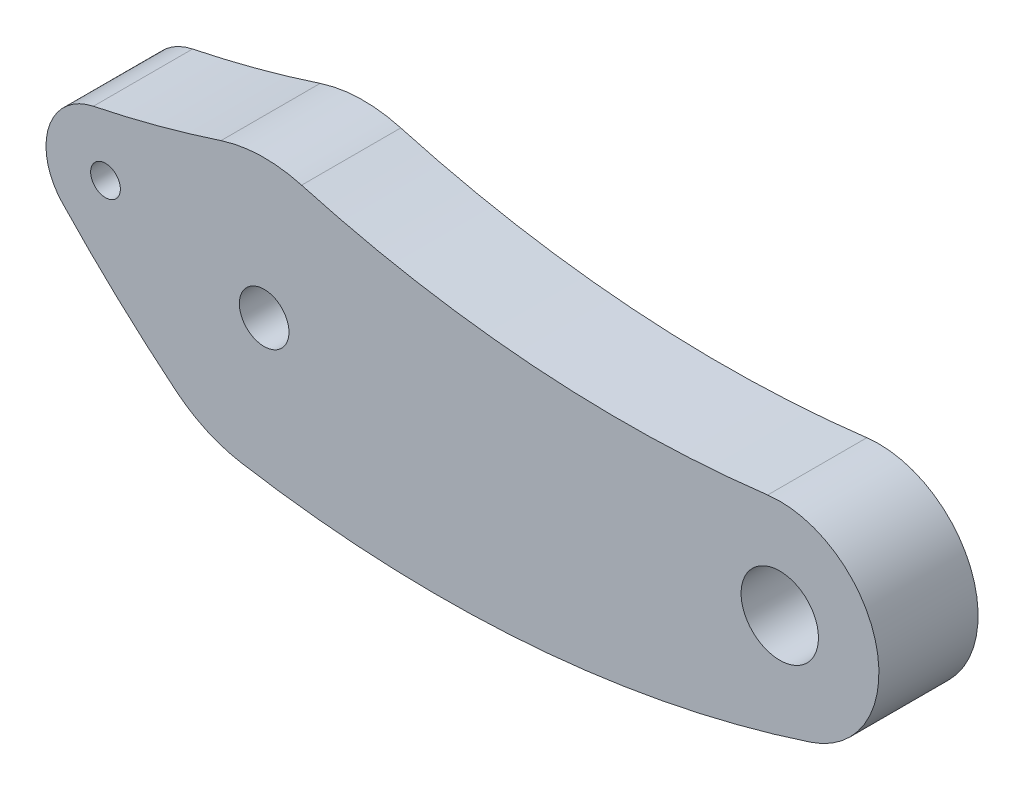
ISO-10303-21;
HEADER;
FILE_DESCRIPTION(('STEP AP214'),'2;1');
FILE_NAME('part.step','',(''),(''),'','','');
FILE_SCHEMA(('AUTOMOTIVE_DESIGN { 1 0 10303 214 1 1 1 1 }'));
ENDSEC;
DATA;
#1=APPLICATION_CONTEXT('core data for automotive mechanical design processes');
#2=APPLICATION_PROTOCOL_DEFINITION('international standard','automotive_design',2000,#1);
#3=PRODUCT_CONTEXT('',#1,'mechanical');
#4=PRODUCT('Part','Part','',(#3));
#5=PRODUCT_RELATED_PRODUCT_CATEGORY('part','',(#4));
#6=PRODUCT_DEFINITION_FORMATION('','',#4);
#7=PRODUCT_DEFINITION_CONTEXT('part definition',#1,'design');
#8=PRODUCT_DEFINITION('design','',#6,#7);
#9=PRODUCT_DEFINITION_SHAPE('','',#8);
#10=(LENGTH_UNIT() NAMED_UNIT(*) SI_UNIT(.MILLI.,.METRE.));
#11=(NAMED_UNIT(*) PLANE_ANGLE_UNIT() SI_UNIT($,.RADIAN.));
#12=(NAMED_UNIT(*) SI_UNIT($,.STERADIAN.) SOLID_ANGLE_UNIT());
#13=UNCERTAINTY_MEASURE_WITH_UNIT(LENGTH_MEASURE(1.E-05),#10,'distance_accuracy_value','');
#14=(GEOMETRIC_REPRESENTATION_CONTEXT(3) GLOBAL_UNCERTAINTY_ASSIGNED_CONTEXT((#13)) GLOBAL_UNIT_ASSIGNED_CONTEXT((#10,
#11,#12)) REPRESENTATION_CONTEXT('',''));
#15=CARTESIAN_POINT('',(0.,0.,0.));
#16=DIRECTION('',(0.,0.,1.));
#17=DIRECTION('',(1.,0.,0.));
#18=AXIS2_PLACEMENT_3D('',#15,#16,#17);
#19=CARTESIAN_POINT('',(17.4230769230769,26.1282680354543,5.));
#20=DIRECTION('',(0.,0.,1.));
#21=DIRECTION('',(1.,0.,0.));
#22=AXIS2_PLACEMENT_3D('',#19,#20,#21);
#23=PLANE('',#22);
#24=CARTESIAN_POINT('',(26.,0.,5.));
#25=DIRECTION('',(0.,0.,1.));
#26=DIRECTION('',(1.,0.,0.));
#27=AXIS2_PLACEMENT_3D('',#24,#25,#26);
#28=CIRCLE('',#27,1.95);
#29=CARTESIAN_POINT('',(27.95,0.,5.));
#30=VERTEX_POINT('',#29);
#31=EDGE_CURVE('E217',#30,#30,#28,.T.);
#32=ORIENTED_EDGE('',*,*,#31,.F.);
#33=EDGE_LOOP('',(#32));
#34=FACE_BOUND('',#33,.T.);
#35=CARTESIAN_POINT('',(8.84615384615384,52.2565360709087,5.));
#36=DIRECTION('',(0.,0.,1.));
#37=DIRECTION('',(1.,0.,0.));
#38=AXIS2_PLACEMENT_3D('',#35,#36,#37);
#39=CIRCLE('',#38,60.);
#40=CARTESIAN_POINT('',(-1.16835994194485,-6.90180665087473,5.));
#41=VERTEX_POINT('',#40);
#42=CARTESIAN_POINT('',(27.5594405594406,-4.75059418826443,5.));
#43=VERTEX_POINT('',#42);
#44=EDGE_CURVE('E168',#41,#43,#39,.T.);
#45=ORIENTED_EDGE('',*,*,#44,.T.);
#46=CARTESIAN_POINT('',(26.,0.,5.));
#47=DIRECTION('',(0.,0.,1.));
#48=DIRECTION('',(1.,0.,0.));
#49=AXIS2_PLACEMENT_3D('',#46,#47,#48);
#50=CIRCLE('',#49,5.);
#51=CARTESIAN_POINT('',(25.3905325443787,4.9627159318803,5.));
#52=VERTEX_POINT('',#51);
#53=EDGE_CURVE('E104',#43,#52,#50,.T.);
#54=ORIENTED_EDGE('',*,*,#53,.T.);
#55=CARTESIAN_POINT('',(18.0769230769231,64.5153071144438,5.));
#56=DIRECTION('',(0.,0.,-1.));
#57=DIRECTION('',(1.,0.,0.));
#58=AXIS2_PLACEMENT_3D('',#55,#56,#57);
#59=CIRCLE('',#58,60.);
#60=CARTESIAN_POINT('',(1.88863375430538,6.74040522091205,5.));
#61=VERTEX_POINT('',#60);
#62=EDGE_CURVE('E189',#52,#61,#59,.T.);
#63=ORIENTED_EDGE('',*,*,#62,.T.);
#64=CARTESIAN_POINT('',(0.,0.,5.));
#65=DIRECTION('',(0.,0.,1.));
#66=DIRECTION('',(1.,0.,0.));
#67=AXIS2_PLACEMENT_3D('',#64,#65,#66);
#68=CIRCLE('',#67,7.);
#69=CARTESIAN_POINT('',(-2.17627564751809,6.65310636515152,5.));
#70=VERTEX_POINT('',#69);
#71=EDGE_CURVE('E203',#61,#70,#68,.T.);
#72=ORIENTED_EDGE('',*,*,#71,.T.);
#73=CARTESIAN_POINT('',(-20.8300669119589,63.6797323521646,5.));
#74=DIRECTION('',(0.,0.,-1.));
#75=DIRECTION('',(1.,0.,0.));
#76=AXIS2_PLACEMENT_3D('',#73,#74,#75);
#77=CIRCLE('',#76,60.);
#78=CARTESIAN_POINT('',(-8.61095556723614,4.93713011200784,5.));
#79=VERTEX_POINT('',#78);
#80=EDGE_CURVE('E123',#70,#79,#77,.T.);
#81=ORIENTED_EDGE('',*,*,#80,.T.);
#82=CARTESIAN_POINT('',(-8.,2.,5.));
#83=DIRECTION('',(0.,0.,1.));
#84=DIRECTION('',(1.,0.,0.));
#85=AXIS2_PLACEMENT_3D('',#82,#83,#84);
#86=CIRCLE('',#85,3.);
#87=CARTESIAN_POINT('',(-10.184976202814,-0.055694284940338,5.));
#88=VERTEX_POINT('',#87);
#89=EDGE_CURVE('E117',#79,#88,#86,.T.);
#90=ORIENTED_EDGE('',*,*,#89,.T.);
#91=CARTESIAN_POINT('',(33.5145478534666,41.0581914138664,5.));
#92=DIRECTION('',(0.,0.,1.));
#93=DIRECTION('',(1.,0.,0.));
#94=AXIS2_PLACEMENT_3D('',#91,#92,#93);
#95=CIRCLE('',#94,60.);
#96=CARTESIAN_POINT('',(-4.42644971649557,-5.42277999805785,5.));
#97=VERTEX_POINT('',#96);
#98=EDGE_CURVE('E121',#88,#97,#95,.T.);
#99=ORIENTED_EDGE('',*,*,#98,.T.);
#100=CARTESIAN_POINT('',(0.,0.,5.));
#101=DIRECTION('',(0.,0.,1.));
#102=DIRECTION('',(1.,0.,0.));
#103=AXIS2_PLACEMENT_3D('',#100,#101,#102);
#104=CIRCLE('',#103,7.);
#105=EDGE_CURVE('E61',#97,#41,#104,.T.);
#106=ORIENTED_EDGE('',*,*,#105,.T.);
#107=EDGE_LOOP('',(#45,#54,#63,#72,#81,#90,#99,#106));
#108=FACE_BOUND('',#107,.T.);
#109=CARTESIAN_POINT('',(0.,0.,5.));
#110=DIRECTION('',(0.,0.,1.));
#111=DIRECTION('',(1.,0.,0.));
#112=AXIS2_PLACEMENT_3D('',#109,#110,#111);
#113=CIRCLE('',#112,1.25);
#114=CARTESIAN_POINT('',(1.25,0.,5.));
#115=VERTEX_POINT('',#114);
#116=EDGE_CURVE('E150',#115,#115,#113,.T.);
#117=ORIENTED_EDGE('',*,*,#116,.F.);
#118=EDGE_LOOP('',(#117));
#119=FACE_BOUND('',#118,.T.);
#120=CARTESIAN_POINT('',(-8.,2.,5.));
#121=DIRECTION('',(0.,0.,1.));
#122=DIRECTION('',(1.,0.,0.));
#123=AXIS2_PLACEMENT_3D('',#120,#121,#122);
#124=CIRCLE('',#123,0.75);
#125=CARTESIAN_POINT('',(-7.25,2.,5.));
#126=VERTEX_POINT('',#125);
#127=EDGE_CURVE('E225',#126,#126,#124,.T.);
#128=ORIENTED_EDGE('',*,*,#127,.F.);
#129=EDGE_LOOP('',(#128));
#130=FACE_BOUND('',#129,.T.);
#131=ADVANCED_FACE('F43',(#34,#108,#119,#130),#23,.T.);
#132=CARTESIAN_POINT('',(17.4230769230769,26.1282680354543,0.));
#133=DIRECTION('',(0.,0.,1.));
#134=DIRECTION('',(1.,0.,0.));
#135=AXIS2_PLACEMENT_3D('',#132,#133,#134);
#136=PLANE('',#135);
#137=CARTESIAN_POINT('',(8.84615384615384,52.2565360709087,0.));
#138=DIRECTION('',(0.,0.,1.));
#139=DIRECTION('',(1.,0.,0.));
#140=AXIS2_PLACEMENT_3D('',#137,#138,#139);
#141=CIRCLE('',#140,60.);
#142=CARTESIAN_POINT('',(-1.16835994194485,-6.90180665087473,0.));
#143=VERTEX_POINT('',#142);
#144=CARTESIAN_POINT('',(27.5594405594406,-4.75059418826443,0.));
#145=VERTEX_POINT('',#144);
#146=EDGE_CURVE('E145',#143,#145,#141,.T.);
#147=ORIENTED_EDGE('',*,*,#146,.F.);
#148=CARTESIAN_POINT('',(0.,0.,0.));
#149=DIRECTION('',(0.,0.,1.));
#150=DIRECTION('',(1.,0.,0.));
#151=AXIS2_PLACEMENT_3D('',#148,#149,#150);
#152=CIRCLE('',#151,7.);
#153=CARTESIAN_POINT('',(-4.42644971649557,-5.42277999805785,0.));
#154=VERTEX_POINT('',#153);
#155=EDGE_CURVE('E96',#154,#143,#152,.T.);
#156=ORIENTED_EDGE('',*,*,#155,.F.);
#157=CARTESIAN_POINT('',(33.5145478534666,41.0581914138664,0.));
#158=DIRECTION('',(0.,0.,1.));
#159=DIRECTION('',(1.,0.,0.));
#160=AXIS2_PLACEMENT_3D('',#157,#158,#159);
#161=CIRCLE('',#160,60.);
#162=CARTESIAN_POINT('',(-10.184976202814,-0.055694284940338,0.));
#163=VERTEX_POINT('',#162);
#164=EDGE_CURVE('E90',#163,#154,#161,.T.);
#165=ORIENTED_EDGE('',*,*,#164,.F.);
#166=CARTESIAN_POINT('',(-8.,2.,0.));
#167=DIRECTION('',(0.,0.,1.));
#168=DIRECTION('',(1.,0.,0.));
#169=AXIS2_PLACEMENT_3D('',#166,#167,#168);
#170=CIRCLE('',#169,3.);
#171=CARTESIAN_POINT('',(-8.61095556723614,4.93713011200784,0.));
#172=VERTEX_POINT('',#171);
#173=EDGE_CURVE('E132',#172,#163,#170,.T.);
#174=ORIENTED_EDGE('',*,*,#173,.F.);
#175=CARTESIAN_POINT('',(-20.8300669119589,63.6797323521646,0.));
#176=DIRECTION('',(0.,0.,-1.));
#177=DIRECTION('',(1.,0.,0.));
#178=AXIS2_PLACEMENT_3D('',#175,#176,#177);
#179=CIRCLE('',#178,60.);
#180=CARTESIAN_POINT('',(-2.17627564751809,6.65310636515152,0.));
#181=VERTEX_POINT('',#180);
#182=EDGE_CURVE('E159',#181,#172,#179,.T.);
#183=ORIENTED_EDGE('',*,*,#182,.F.);
#184=CARTESIAN_POINT('',(0.,0.,0.));
#185=DIRECTION('',(0.,0.,1.));
#186=DIRECTION('',(1.,0.,0.));
#187=AXIS2_PLACEMENT_3D('',#184,#185,#186);
#188=CIRCLE('',#187,7.);
#189=CARTESIAN_POINT('',(1.88863375430538,6.74040522091205,0.));
#190=VERTEX_POINT('',#189);
#191=EDGE_CURVE('E156',#190,#181,#188,.T.);
#192=ORIENTED_EDGE('',*,*,#191,.F.);
#193=CARTESIAN_POINT('',(18.0769230769231,64.5153071144438,0.));
#194=DIRECTION('',(0.,0.,-1.));
#195=DIRECTION('',(1.,0.,0.));
#196=AXIS2_PLACEMENT_3D('',#193,#194,#195);
#197=CIRCLE('',#196,60.);
#198=CARTESIAN_POINT('',(25.3905325443787,4.9627159318803,0.));
#199=VERTEX_POINT('',#198);
#200=EDGE_CURVE('E153',#199,#190,#197,.T.);
#201=ORIENTED_EDGE('',*,*,#200,.F.);
#202=CARTESIAN_POINT('',(26.,0.,0.));
#203=DIRECTION('',(0.,0.,1.));
#204=DIRECTION('',(1.,0.,0.));
#205=AXIS2_PLACEMENT_3D('',#202,#203,#204);
#206=CIRCLE('',#205,5.);
#207=EDGE_CURVE('E149',#145,#199,#206,.T.);
#208=ORIENTED_EDGE('',*,*,#207,.F.);
#209=EDGE_LOOP('',(#147,#156,#165,#174,#183,#192,#201,#208));
#210=FACE_BOUND('',#209,.T.);
#211=CARTESIAN_POINT('',(0.,0.,0.));
#212=DIRECTION('',(0.,0.,1.));
#213=DIRECTION('',(1.,0.,0.));
#214=AXIS2_PLACEMENT_3D('',#211,#212,#213);
#215=CIRCLE('',#214,1.25);
#216=CARTESIAN_POINT('',(1.25,0.,0.));
#217=VERTEX_POINT('',#216);
#218=EDGE_CURVE('E213',#217,#217,#215,.T.);
#219=ORIENTED_EDGE('',*,*,#218,.T.);
#220=EDGE_LOOP('',(#219));
#221=FACE_BOUND('',#220,.T.);
#222=CARTESIAN_POINT('',(26.,0.,0.));
#223=DIRECTION('',(0.,0.,1.));
#224=DIRECTION('',(1.,0.,0.));
#225=AXIS2_PLACEMENT_3D('',#222,#223,#224);
#226=CIRCLE('',#225,1.95);
#227=CARTESIAN_POINT('',(27.95,0.,0.));
#228=VERTEX_POINT('',#227);
#229=EDGE_CURVE('E221',#228,#228,#226,.T.);
#230=ORIENTED_EDGE('',*,*,#229,.T.);
#231=EDGE_LOOP('',(#230));
#232=FACE_BOUND('',#231,.T.);
#233=CARTESIAN_POINT('',(-8.,2.,0.));
#234=DIRECTION('',(0.,0.,1.));
#235=DIRECTION('',(1.,0.,0.));
#236=AXIS2_PLACEMENT_3D('',#233,#234,#235);
#237=CIRCLE('',#236,0.75);
#238=CARTESIAN_POINT('',(-7.25,2.,0.));
#239=VERTEX_POINT('',#238);
#240=EDGE_CURVE('E229',#239,#239,#237,.T.);
#241=ORIENTED_EDGE('',*,*,#240,.T.);
#242=EDGE_LOOP('',(#241));
#243=FACE_BOUND('',#242,.T.);
#244=ADVANCED_FACE('F193',(#210,#221,#232,#243),#136,.F.);
#245=CARTESIAN_POINT('',(8.84615384615384,52.2565360709087,5.));
#246=DIRECTION('',(0.,0.,-1.));
#247=DIRECTION('',(-1.,0.,0.));
#248=AXIS2_PLACEMENT_3D('',#245,#246,#247);
#249=CYLINDRICAL_SURFACE('',#248,60.);
#250=ORIENTED_EDGE('',*,*,#146,.T.);
#251=DIRECTION('',(0.,0.,-1.));
#252=VECTOR('',#251,1.);
#253=CARTESIAN_POINT('',(27.5594405594406,-4.75059418826443,5.));
#254=LINE('',#253,#252);
#255=EDGE_CURVE('E11',#43,#145,#254,.T.);
#256=ORIENTED_EDGE('',*,*,#255,.F.);
#257=ORIENTED_EDGE('',*,*,#44,.F.);
#258=DIRECTION('',(0.,0.,-1.));
#259=VECTOR('',#258,1.);
#260=CARTESIAN_POINT('',(-1.16835994194485,-6.90180665087473,5.));
#261=LINE('',#260,#259);
#262=EDGE_CURVE('E141',#41,#143,#261,.T.);
#263=ORIENTED_EDGE('',*,*,#262,.T.);
#264=EDGE_LOOP('',(#250,#256,#257,#263));
#265=FACE_BOUND('',#264,.T.);
#266=ADVANCED_FACE('F45',(#265),#249,.T.);
#267=CARTESIAN_POINT('',(26.,0.,5.));
#268=DIRECTION('',(0.,0.,-1.));
#269=DIRECTION('',(-1.,0.,0.));
#270=AXIS2_PLACEMENT_3D('',#267,#268,#269);
#271=CYLINDRICAL_SURFACE('',#270,5.);
#272=ORIENTED_EDGE('',*,*,#207,.T.);
#273=DIRECTION('',(0.,0.,-1.));
#274=VECTOR('',#273,1.);
#275=CARTESIAN_POINT('',(25.3905325443787,4.9627159318803,5.));
#276=LINE('',#275,#274);
#277=EDGE_CURVE('E53',#52,#199,#276,.T.);
#278=ORIENTED_EDGE('',*,*,#277,.F.);
#279=ORIENTED_EDGE('',*,*,#53,.F.);
#280=ORIENTED_EDGE('',*,*,#255,.T.);
#281=EDGE_LOOP('',(#272,#278,#279,#280));
#282=FACE_BOUND('',#281,.T.);
#283=ADVANCED_FACE('F264',(#282),#271,.T.);
#284=CARTESIAN_POINT('',(18.0769230769231,64.5153071144438,5.));
#285=DIRECTION('',(0.,0.,-1.));
#286=DIRECTION('',(-1.,0.,0.));
#287=AXIS2_PLACEMENT_3D('',#284,#285,#286);
#288=CYLINDRICAL_SURFACE('',#287,60.);
#289=ORIENTED_EDGE('',*,*,#200,.T.);
#290=DIRECTION('',(0.,0.,-1.));
#291=VECTOR('',#290,1.);
#292=CARTESIAN_POINT('',(1.88863375430538,6.74040522091205,5.));
#293=LINE('',#292,#291);
#294=EDGE_CURVE('E179',#61,#190,#293,.T.);
#295=ORIENTED_EDGE('',*,*,#294,.F.);
#296=ORIENTED_EDGE('',*,*,#62,.F.);
#297=ORIENTED_EDGE('',*,*,#277,.T.);
#298=EDGE_LOOP('',(#289,#295,#296,#297));
#299=FACE_BOUND('',#298,.T.);
#300=ADVANCED_FACE('F187',(#299),#288,.F.);
#301=CARTESIAN_POINT('',(0.,0.,5.));
#302=DIRECTION('',(0.,0.,-1.));
#303=DIRECTION('',(-1.,0.,0.));
#304=AXIS2_PLACEMENT_3D('',#301,#302,#303);
#305=CYLINDRICAL_SURFACE('',#304,7.);
#306=ORIENTED_EDGE('',*,*,#191,.T.);
#307=DIRECTION('',(0.,0.,-1.));
#308=VECTOR('',#307,1.);
#309=CARTESIAN_POINT('',(-2.17627564751809,6.65310636515152,5.));
#310=LINE('',#309,#308);
#311=EDGE_CURVE('E175',#70,#181,#310,.T.);
#312=ORIENTED_EDGE('',*,*,#311,.F.);
#313=ORIENTED_EDGE('',*,*,#71,.F.);
#314=ORIENTED_EDGE('',*,*,#294,.T.);
#315=EDGE_LOOP('',(#306,#312,#313,#314));
#316=FACE_BOUND('',#315,.T.);
#317=ADVANCED_FACE('F198',(#316),#305,.T.);
#318=CARTESIAN_POINT('',(-20.8300669119589,63.6797323521646,5.));
#319=DIRECTION('',(0.,0.,-1.));
#320=DIRECTION('',(-1.,0.,0.));
#321=AXIS2_PLACEMENT_3D('',#318,#319,#320);
#322=CYLINDRICAL_SURFACE('',#321,60.);
#323=ORIENTED_EDGE('',*,*,#182,.T.);
#324=DIRECTION('',(0.,0.,-1.));
#325=VECTOR('',#324,1.);
#326=CARTESIAN_POINT('',(-8.61095556723614,4.93713011200784,5.));
#327=LINE('',#326,#325);
#328=EDGE_CURVE('E134',#79,#172,#327,.T.);
#329=ORIENTED_EDGE('',*,*,#328,.F.);
#330=ORIENTED_EDGE('',*,*,#80,.F.);
#331=ORIENTED_EDGE('',*,*,#311,.T.);
#332=EDGE_LOOP('',(#323,#329,#330,#331));
#333=FACE_BOUND('',#332,.T.);
#334=ADVANCED_FACE('F201',(#333),#322,.F.);
#335=CARTESIAN_POINT('',(-8.,2.,5.));
#336=DIRECTION('',(0.,0.,-1.));
#337=DIRECTION('',(-1.,0.,0.));
#338=AXIS2_PLACEMENT_3D('',#335,#336,#337);
#339=CYLINDRICAL_SURFACE('',#338,3.);
#340=ORIENTED_EDGE('',*,*,#173,.T.);
#341=DIRECTION('',(0.,0.,-1.));
#342=VECTOR('',#341,1.);
#343=CARTESIAN_POINT('',(-10.184976202814,-0.055694284940338,5.));
#344=LINE('',#343,#342);
#345=EDGE_CURVE('E129',#88,#163,#344,.T.);
#346=ORIENTED_EDGE('',*,*,#345,.F.);
#347=ORIENTED_EDGE('',*,*,#89,.F.);
#348=ORIENTED_EDGE('',*,*,#328,.T.);
#349=EDGE_LOOP('',(#340,#346,#347,#348));
#350=FACE_BOUND('',#349,.T.);
#351=ADVANCED_FACE('F130',(#350),#339,.T.);
#352=CARTESIAN_POINT('',(33.5145478534666,41.0581914138664,5.));
#353=DIRECTION('',(0.,0.,-1.));
#354=DIRECTION('',(-1.,0.,0.));
#355=AXIS2_PLACEMENT_3D('',#352,#353,#354);
#356=CYLINDRICAL_SURFACE('',#355,60.);
#357=ORIENTED_EDGE('',*,*,#164,.T.);
#358=DIRECTION('',(0.,0.,-1.));
#359=VECTOR('',#358,1.);
#360=CARTESIAN_POINT('',(-4.42644971649557,-5.42277999805785,5.));
#361=LINE('',#360,#359);
#362=EDGE_CURVE('E135',#97,#154,#361,.T.);
#363=ORIENTED_EDGE('',*,*,#362,.F.);
#364=ORIENTED_EDGE('',*,*,#98,.F.);
#365=ORIENTED_EDGE('',*,*,#345,.T.);
#366=EDGE_LOOP('',(#357,#363,#364,#365));
#367=FACE_BOUND('',#366,.T.);
#368=ADVANCED_FACE('F137',(#367),#356,.T.);
#369=CARTESIAN_POINT('',(0.,0.,5.));
#370=DIRECTION('',(0.,0.,-1.));
#371=DIRECTION('',(-1.,0.,0.));
#372=AXIS2_PLACEMENT_3D('',#369,#370,#371);
#373=CYLINDRICAL_SURFACE('',#372,7.);
#374=ORIENTED_EDGE('',*,*,#155,.T.);
#375=ORIENTED_EDGE('',*,*,#262,.F.);
#376=ORIENTED_EDGE('',*,*,#105,.F.);
#377=ORIENTED_EDGE('',*,*,#362,.T.);
#378=EDGE_LOOP('',(#374,#375,#376,#377));
#379=FACE_BOUND('',#378,.T.);
#380=ADVANCED_FACE('F252',(#379),#373,.T.);
#381=CARTESIAN_POINT('',(0.,0.,5.));
#382=DIRECTION('',(0.,0.,-1.));
#383=DIRECTION('',(-1.,0.,0.));
#384=AXIS2_PLACEMENT_3D('',#381,#382,#383);
#385=CYLINDRICAL_SURFACE('',#384,1.25);
#386=ORIENTED_EDGE('',*,*,#116,.T.);
#387=EDGE_LOOP('',(#386));
#388=FACE_BOUND('',#387,.T.);
#389=ORIENTED_EDGE('',*,*,#218,.F.);
#390=EDGE_LOOP('',(#389));
#391=FACE_BOUND('',#390,.T.);
#392=ADVANCED_FACE('F249',(#388,#391),#385,.F.);
#393=CARTESIAN_POINT('',(26.,0.,5.));
#394=DIRECTION('',(0.,0.,-1.));
#395=DIRECTION('',(-1.,0.,0.));
#396=AXIS2_PLACEMENT_3D('',#393,#394,#395);
#397=CYLINDRICAL_SURFACE('',#396,1.95);
#398=ORIENTED_EDGE('',*,*,#31,.T.);
#399=EDGE_LOOP('',(#398));
#400=FACE_BOUND('',#399,.T.);
#401=ORIENTED_EDGE('',*,*,#229,.F.);
#402=EDGE_LOOP('',(#401));
#403=FACE_BOUND('',#402,.T.);
#404=ADVANCED_FACE('F299',(#400,#403),#397,.F.);
#405=CARTESIAN_POINT('',(-8.,2.,5.));
#406=DIRECTION('',(0.,0.,-1.));
#407=DIRECTION('',(-1.,0.,0.));
#408=AXIS2_PLACEMENT_3D('',#405,#406,#407);
#409=CYLINDRICAL_SURFACE('',#408,0.75);
#410=ORIENTED_EDGE('',*,*,#127,.T.);
#411=EDGE_LOOP('',(#410));
#412=FACE_BOUND('',#411,.T.);
#413=ORIENTED_EDGE('',*,*,#240,.F.);
#414=EDGE_LOOP('',(#413));
#415=FACE_BOUND('',#414,.T.);
#416=ADVANCED_FACE('F237',(#412,#415),#409,.F.);
#417=CLOSED_SHELL('',(#131,#244,#266,#283,#300,#317,#334,#351,#368,#380,#392,#404,#416));
#418=MANIFOLD_SOLID_BREP('B2',#417);
#419=ADVANCED_BREP_SHAPE_REPRESENTATION('',(#18,#418),#14);
#420=SHAPE_DEFINITION_REPRESENTATION(#9,#419);
ENDSEC;
END-ISO-10303-21;
